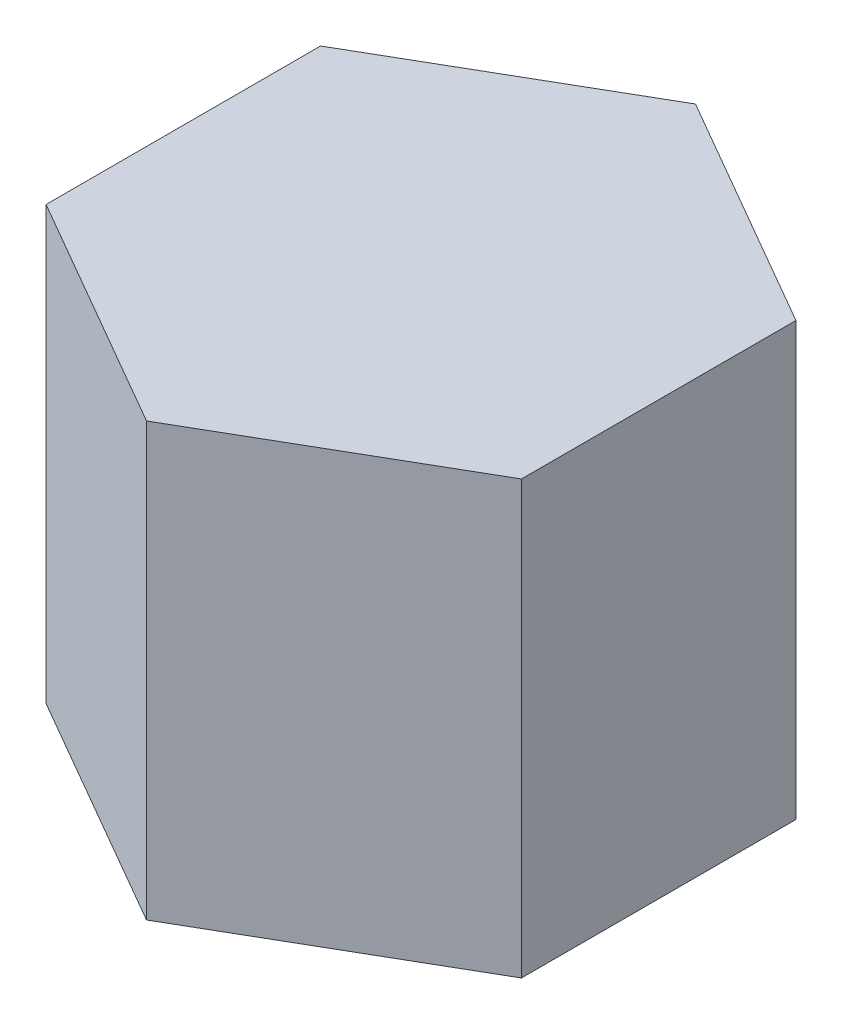
ISO-10303-21;
HEADER;
FILE_DESCRIPTION(('STEP AP214'),'2;1');
FILE_NAME('part.step','',(''),(''),'','','');
FILE_SCHEMA(('AUTOMOTIVE_DESIGN { 1 0 10303 214 1 1 1 1 }'));
ENDSEC;
DATA;
#1=APPLICATION_CONTEXT('core data for automotive mechanical design processes');
#2=APPLICATION_PROTOCOL_DEFINITION('international standard','automotive_design',2000,#1);
#3=PRODUCT_CONTEXT('',#1,'mechanical');
#4=PRODUCT('Part','Part','',(#3));
#5=PRODUCT_RELATED_PRODUCT_CATEGORY('part','',(#4));
#6=PRODUCT_DEFINITION_FORMATION('','',#4);
#7=PRODUCT_DEFINITION_CONTEXT('part definition',#1,'design');
#8=PRODUCT_DEFINITION('design','',#6,#7);
#9=PRODUCT_DEFINITION_SHAPE('','',#8);
#10=(LENGTH_UNIT() NAMED_UNIT(*) SI_UNIT(.MILLI.,.METRE.));
#11=(NAMED_UNIT(*) PLANE_ANGLE_UNIT() SI_UNIT($,.RADIAN.));
#12=(NAMED_UNIT(*) SI_UNIT($,.STERADIAN.) SOLID_ANGLE_UNIT());
#13=UNCERTAINTY_MEASURE_WITH_UNIT(LENGTH_MEASURE(1.E-05),#10,'distance_accuracy_value','');
#14=(GEOMETRIC_REPRESENTATION_CONTEXT(3) GLOBAL_UNCERTAINTY_ASSIGNED_CONTEXT((#13)) GLOBAL_UNIT_ASSIGNED_CONTEXT((#10,
#11,#12)) REPRESENTATION_CONTEXT('',''));
#15=CARTESIAN_POINT('',(0.,0.,0.));
#16=DIRECTION('',(0.,0.,1.));
#17=DIRECTION('',(1.,0.,0.));
#18=AXIS2_PLACEMENT_3D('',#15,#16,#17);
#19=CARTESIAN_POINT('',(10.9999999999999,20.,-6.35085296108602));
#20=DIRECTION('',(-0.499999999999995,0.,0.866025403784442));
#21=DIRECTION('',(0.866025403784442,0.,0.499999999999995));
#22=AXIS2_PLACEMENT_3D('',#19,#20,#21);
#23=PLANE('',#22);
#24=DIRECTION('',(-0.866025403784442,0.,-0.499999999999995));
#25=VECTOR('',#24,1.);
#26=CARTESIAN_POINT('',(10.9999999999999,0.,-6.35085296108602));
#27=LINE('',#26,#25);
#28=CARTESIAN_POINT('',(10.9999999999999,0.,-6.35085296108602));
#29=VERTEX_POINT('',#28);
#30=CARTESIAN_POINT('',(0.,0.,-12.7017059221718));
#31=VERTEX_POINT('',#30);
#32=EDGE_CURVE('E116',#29,#31,#27,.T.);
#33=ORIENTED_EDGE('',*,*,#32,.T.);
#34=DIRECTION('',(0.,-1.,0.));
#35=VECTOR('',#34,1.);
#36=CARTESIAN_POINT('',(0.,20.,-12.7017059221718));
#37=LINE('',#36,#35);
#38=CARTESIAN_POINT('',(0.,20.,-12.7017059221718));
#39=VERTEX_POINT('',#38);
#40=EDGE_CURVE('E11',#39,#31,#37,.T.);
#41=ORIENTED_EDGE('',*,*,#40,.F.);
#42=DIRECTION('',(-0.866025403784442,0.,-0.499999999999995));
#43=VECTOR('',#42,1.);
#44=CARTESIAN_POINT('',(10.9999999999999,20.,-6.35085296108602));
#45=LINE('',#44,#43);
#46=CARTESIAN_POINT('',(10.9999999999999,20.,-6.35085296108602));
#47=VERTEX_POINT('',#46);
#48=EDGE_CURVE('E126',#47,#39,#45,.T.);
#49=ORIENTED_EDGE('',*,*,#48,.F.);
#50=DIRECTION('',(0.,-1.,0.));
#51=VECTOR('',#50,1.);
#52=CARTESIAN_POINT('',(10.9999999999999,20.,-6.35085296108602));
#53=LINE('',#52,#51);
#54=EDGE_CURVE('E112',#47,#29,#53,.T.);
#55=ORIENTED_EDGE('',*,*,#54,.T.);
#56=EDGE_LOOP('',(#33,#41,#49,#55));
#57=FACE_BOUND('',#56,.T.);
#58=ADVANCED_FACE('F32',(#57),#23,.F.);
#59=CARTESIAN_POINT('',(0.,20.,-12.7017059221718));
#60=DIRECTION('',(0.500000000000001,0.,0.866025403784438));
#61=DIRECTION('',(0.866025403784438,0.,-0.500000000000001));
#62=AXIS2_PLACEMENT_3D('',#59,#60,#61);
#63=PLANE('',#62);
#64=DIRECTION('',(-0.866025403784438,0.,0.500000000000001));
#65=VECTOR('',#64,1.);
#66=CARTESIAN_POINT('',(0.,0.,-12.7017059221718));
#67=LINE('',#66,#65);
#68=CARTESIAN_POINT('',(-11.,0.,-6.35085296108586));
#69=VERTEX_POINT('',#68);
#70=EDGE_CURVE('E119',#31,#69,#67,.T.);
#71=ORIENTED_EDGE('',*,*,#70,.T.);
#72=DIRECTION('',(0.,-1.,0.));
#73=VECTOR('',#72,1.);
#74=CARTESIAN_POINT('',(-11.,20.,-6.35085296108586));
#75=LINE('',#74,#73);
#76=CARTESIAN_POINT('',(-11.,20.,-6.35085296108586));
#77=VERTEX_POINT('',#76);
#78=EDGE_CURVE('E40',#77,#69,#75,.T.);
#79=ORIENTED_EDGE('',*,*,#78,.F.);
#80=DIRECTION('',(-0.866025403784438,0.,0.500000000000001));
#81=VECTOR('',#80,1.);
#82=CARTESIAN_POINT('',(0.,20.,-12.7017059221718));
#83=LINE('',#82,#81);
#84=EDGE_CURVE('E85',#39,#77,#83,.T.);
#85=ORIENTED_EDGE('',*,*,#84,.F.);
#86=ORIENTED_EDGE('',*,*,#40,.T.);
#87=EDGE_LOOP('',(#71,#79,#85,#86));
#88=FACE_BOUND('',#87,.T.);
#89=ADVANCED_FACE('F150',(#88),#63,.F.);
#90=CARTESIAN_POINT('',(-11.,20.,-6.35085296108586));
#91=DIRECTION('',(1.,0.,0.));
#92=DIRECTION('',(0.,0.,-1.));
#93=AXIS2_PLACEMENT_3D('',#90,#91,#92);
#94=PLANE('',#93);
#95=DIRECTION('',(0.,0.,1.));
#96=VECTOR('',#95,1.);
#97=CARTESIAN_POINT('',(-11.,0.,-6.35085296108586));
#98=LINE('',#97,#96);
#99=CARTESIAN_POINT('',(-11.,0.,6.35085296108594));
#100=VERTEX_POINT('',#99);
#101=EDGE_CURVE('E121',#69,#100,#98,.T.);
#102=ORIENTED_EDGE('',*,*,#101,.T.);
#103=DIRECTION('',(0.,-1.,0.));
#104=VECTOR('',#103,1.);
#105=CARTESIAN_POINT('',(-11.,20.,6.35085296108594));
#106=LINE('',#105,#104);
#107=CARTESIAN_POINT('',(-11.,20.,6.35085296108594));
#108=VERTEX_POINT('',#107);
#109=EDGE_CURVE('E107',#108,#100,#106,.T.);
#110=ORIENTED_EDGE('',*,*,#109,.F.);
#111=DIRECTION('',(0.,0.,1.));
#112=VECTOR('',#111,1.);
#113=CARTESIAN_POINT('',(-11.,20.,-6.35085296108586));
#114=LINE('',#113,#112);
#115=EDGE_CURVE('E98',#77,#108,#114,.T.);
#116=ORIENTED_EDGE('',*,*,#115,.F.);
#117=ORIENTED_EDGE('',*,*,#78,.T.);
#118=EDGE_LOOP('',(#102,#110,#116,#117));
#119=FACE_BOUND('',#118,.T.);
#120=ADVANCED_FACE('F132',(#119),#94,.F.);
#121=CARTESIAN_POINT('',(-11.,20.,6.35085296108594));
#122=DIRECTION('',(0.499999999999995,0.,-0.866025403784442));
#123=DIRECTION('',(-0.866025403784442,0.,-0.499999999999995));
#124=AXIS2_PLACEMENT_3D('',#121,#122,#123);
#125=PLANE('',#124);
#126=DIRECTION('',(0.866025403784441,0.,0.499999999999995));
#127=VECTOR('',#126,1.);
#128=CARTESIAN_POINT('',(-11.,0.,6.35085296108594));
#129=LINE('',#128,#127);
#130=CARTESIAN_POINT('',(0.,0.,12.7017059221718));
#131=VERTEX_POINT('',#130);
#132=EDGE_CURVE('E106',#100,#131,#129,.T.);
#133=ORIENTED_EDGE('',*,*,#132,.T.);
#134=DIRECTION('',(0.,-1.,0.));
#135=VECTOR('',#134,1.);
#136=CARTESIAN_POINT('',(0.,20.,12.7017059221718));
#137=LINE('',#136,#135);
#138=CARTESIAN_POINT('',(0.,20.,12.7017059221718));
#139=VERTEX_POINT('',#138);
#140=EDGE_CURVE('E103',#139,#131,#137,.T.);
#141=ORIENTED_EDGE('',*,*,#140,.F.);
#142=DIRECTION('',(0.866025403784441,0.,0.499999999999995));
#143=VECTOR('',#142,1.);
#144=CARTESIAN_POINT('',(-11.,20.,6.35085296108594));
#145=LINE('',#144,#143);
#146=EDGE_CURVE('E92',#108,#139,#145,.T.);
#147=ORIENTED_EDGE('',*,*,#146,.F.);
#148=ORIENTED_EDGE('',*,*,#109,.T.);
#149=EDGE_LOOP('',(#133,#141,#147,#148));
#150=FACE_BOUND('',#149,.T.);
#151=ADVANCED_FACE('F104',(#150),#125,.F.);
#152=CARTESIAN_POINT('',(0.,20.,12.7017059221718));
#153=DIRECTION('',(-0.500000000000007,0.,-0.866025403784435));
#154=DIRECTION('',(-0.866025403784435,0.,0.500000000000007));
#155=AXIS2_PLACEMENT_3D('',#152,#153,#154);
#156=PLANE('',#155);
#157=DIRECTION('',(0.866025403784435,0.,-0.500000000000007));
#158=VECTOR('',#157,1.);
#159=CARTESIAN_POINT('',(0.,0.,12.7017059221718));
#160=LINE('',#159,#158);
#161=CARTESIAN_POINT('',(11.0000000000001,0.,6.35085296108579));
#162=VERTEX_POINT('',#161);
#163=EDGE_CURVE('E71',#131,#162,#160,.T.);
#164=ORIENTED_EDGE('',*,*,#163,.T.);
#165=DIRECTION('',(0.,-1.,0.));
#166=VECTOR('',#165,1.);
#167=CARTESIAN_POINT('',(11.0000000000001,20.,6.35085296108579));
#168=LINE('',#167,#166);
#169=CARTESIAN_POINT('',(11.0000000000001,20.,6.35085296108579));
#170=VERTEX_POINT('',#169);
#171=EDGE_CURVE('E108',#170,#162,#168,.T.);
#172=ORIENTED_EDGE('',*,*,#171,.F.);
#173=DIRECTION('',(0.866025403784435,0.,-0.500000000000007));
#174=VECTOR('',#173,1.);
#175=CARTESIAN_POINT('',(0.,20.,12.7017059221718));
#176=LINE('',#175,#174);
#177=EDGE_CURVE('E96',#139,#170,#176,.T.);
#178=ORIENTED_EDGE('',*,*,#177,.F.);
#179=ORIENTED_EDGE('',*,*,#140,.T.);
#180=EDGE_LOOP('',(#164,#172,#178,#179));
#181=FACE_BOUND('',#180,.T.);
#182=ADVANCED_FACE('F110',(#181),#156,.F.);
#183=CARTESIAN_POINT('',(11.0000000000001,20.,6.35085296108579));
#184=DIRECTION('',(-1.,0.,0.));
#185=DIRECTION('',(0.,0.,1.));
#186=AXIS2_PLACEMENT_3D('',#183,#184,#185);
#187=PLANE('',#186);
#188=DIRECTION('',(0.,0.,-1.));
#189=VECTOR('',#188,1.);
#190=CARTESIAN_POINT('',(11.0000000000001,0.,6.35085296108579));
#191=LINE('',#190,#189);
#192=EDGE_CURVE('E77',#162,#29,#191,.T.);
#193=ORIENTED_EDGE('',*,*,#192,.T.);
#194=ORIENTED_EDGE('',*,*,#54,.F.);
#195=DIRECTION('',(0.,0.,-1.));
#196=VECTOR('',#195,1.);
#197=CARTESIAN_POINT('',(11.0000000000001,20.,6.35085296108579));
#198=LINE('',#197,#196);
#199=EDGE_CURVE('E48',#170,#47,#198,.T.);
#200=ORIENTED_EDGE('',*,*,#199,.F.);
#201=ORIENTED_EDGE('',*,*,#171,.T.);
#202=EDGE_LOOP('',(#193,#194,#200,#201));
#203=FACE_BOUND('',#202,.T.);
#204=ADVANCED_FACE('F139',(#203),#187,.F.);
#205=CARTESIAN_POINT('',(0.,20.,0.));
#206=DIRECTION('',(0.,1.,0.));
#207=DIRECTION('',(0.,0.,1.));
#208=AXIS2_PLACEMENT_3D('',#205,#206,#207);
#209=PLANE('',#208);
#210=ORIENTED_EDGE('',*,*,#48,.T.);
#211=ORIENTED_EDGE('',*,*,#84,.T.);
#212=ORIENTED_EDGE('',*,*,#115,.T.);
#213=ORIENTED_EDGE('',*,*,#146,.T.);
#214=ORIENTED_EDGE('',*,*,#177,.T.);
#215=ORIENTED_EDGE('',*,*,#199,.T.);
#216=EDGE_LOOP('',(#210,#211,#212,#213,#214,#215));
#217=FACE_BOUND('',#216,.T.);
#218=ADVANCED_FACE('F94',(#217),#209,.T.);
#219=CARTESIAN_POINT('',(0.,0.,0.));
#220=DIRECTION('',(0.,1.,0.));
#221=DIRECTION('',(0.,0.,1.));
#222=AXIS2_PLACEMENT_3D('',#219,#220,#221);
#223=PLANE('',#222);
#224=ORIENTED_EDGE('',*,*,#32,.F.);
#225=ORIENTED_EDGE('',*,*,#192,.F.);
#226=ORIENTED_EDGE('',*,*,#163,.F.);
#227=ORIENTED_EDGE('',*,*,#132,.F.);
#228=ORIENTED_EDGE('',*,*,#101,.F.);
#229=ORIENTED_EDGE('',*,*,#70,.F.);
#230=EDGE_LOOP('',(#224,#225,#226,#227,#228,#229));
#231=FACE_BOUND('',#230,.T.);
#232=ADVANCED_FACE('F135',(#231),#223,.F.);
#233=CLOSED_SHELL('',(#58,#89,#120,#151,#182,#204,#218,#232));
#234=MANIFOLD_SOLID_BREP('B2',#233);
#235=ADVANCED_BREP_SHAPE_REPRESENTATION('',(#18,#234),#14);
#236=SHAPE_DEFINITION_REPRESENTATION(#9,#235);
ENDSEC;
END-ISO-10303-21;
